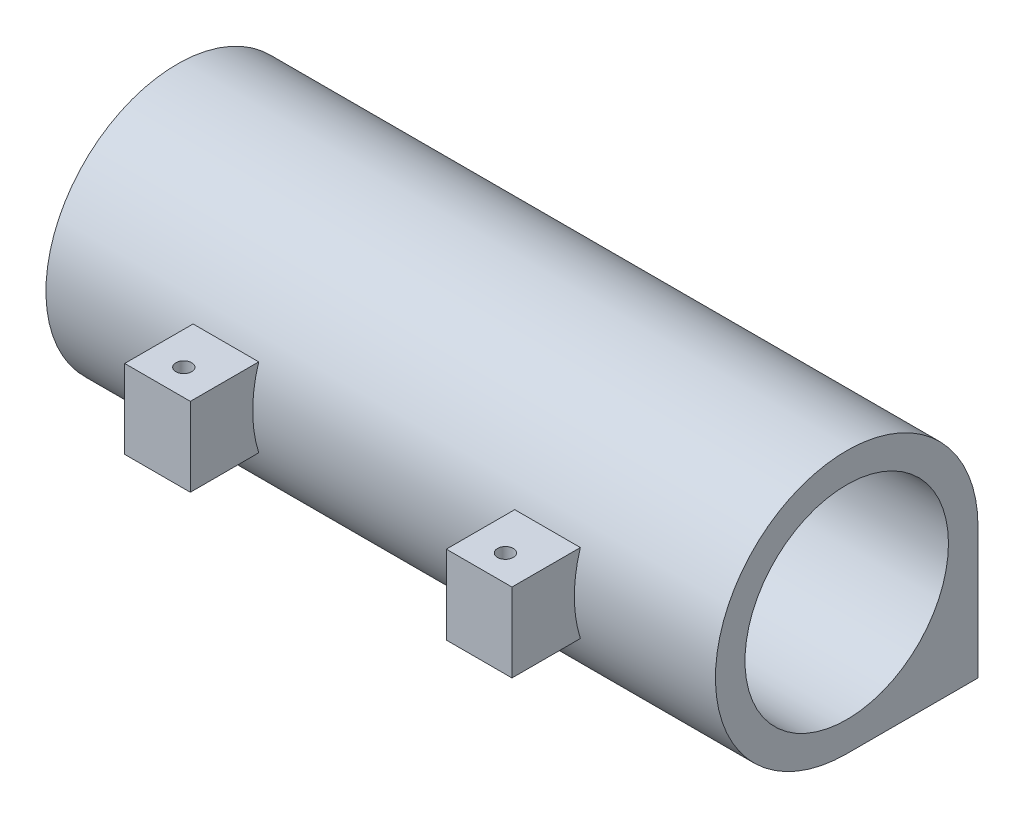
ISO-10303-21;
HEADER;
FILE_DESCRIPTION(('STEP AP214'),'2;1');
FILE_NAME('part.step','',(''),(''),'','','');
FILE_SCHEMA(('AUTOMOTIVE_DESIGN { 1 0 10303 214 1 1 1 1 }'));
ENDSEC;
DATA;
#1=APPLICATION_CONTEXT('core data for automotive mechanical design processes');
#2=APPLICATION_PROTOCOL_DEFINITION('international standard','automotive_design',2000,#1);
#3=PRODUCT_CONTEXT('',#1,'mechanical');
#4=PRODUCT('Part','Part','',(#3));
#5=PRODUCT_RELATED_PRODUCT_CATEGORY('part','',(#4));
#6=PRODUCT_DEFINITION_FORMATION('','',#4);
#7=PRODUCT_DEFINITION_CONTEXT('part definition',#1,'design');
#8=PRODUCT_DEFINITION('design','',#6,#7);
#9=PRODUCT_DEFINITION_SHAPE('','',#8);
#10=(LENGTH_UNIT() NAMED_UNIT(*) SI_UNIT(.MILLI.,.METRE.));
#11=(NAMED_UNIT(*) PLANE_ANGLE_UNIT() SI_UNIT($,.RADIAN.));
#12=(NAMED_UNIT(*) SI_UNIT($,.STERADIAN.) SOLID_ANGLE_UNIT());
#13=UNCERTAINTY_MEASURE_WITH_UNIT(LENGTH_MEASURE(1.E-05),#10,'distance_accuracy_value','');
#14=(GEOMETRIC_REPRESENTATION_CONTEXT(3) GLOBAL_UNCERTAINTY_ASSIGNED_CONTEXT((#13)) GLOBAL_UNIT_ASSIGNED_CONTEXT((#10,
#11,#12)) REPRESENTATION_CONTEXT('',''));
#15=CARTESIAN_POINT('',(0.,0.,0.));
#16=DIRECTION('',(0.,0.,1.));
#17=DIRECTION('',(1.,0.,0.));
#18=AXIS2_PLACEMENT_3D('',#15,#16,#17);
#19=CARTESIAN_POINT('',(0.,1.14590202813815,3.94518317727533));
#20=DIRECTION('',(1.,0.,0.));
#21=DIRECTION('',(0.,0.,-1.));
#22=AXIS2_PLACEMENT_3D('',#19,#20,#21);
#23=CYLINDRICAL_SURFACE('',#22,10.);
#24=CARTESIAN_POINT('',(15.75,1.14590202813815,3.94518317727533));
#25=DIRECTION('',(-1.,0.,0.));
#26=DIRECTION('',(0.,0.,-1.));
#27=AXIS2_PLACEMENT_3D('',#24,#25,#26);
#28=CIRCLE('',#27,10.);
#29=CARTESIAN_POINT('',(15.75,-1.85409797186185,13.4845751914448));
#30=VERTEX_POINT('',#29);
#31=CARTESIAN_POINT('',(15.75,4.14590202813815,13.4845751914448));
#32=VERTEX_POINT('',#31);
#33=EDGE_CURVE('E203',#30,#32,#28,.T.);
#34=ORIENTED_EDGE('',*,*,#33,.F.);
#35=DIRECTION('',(1.,0.,0.));
#36=VECTOR('',#35,1.);
#37=CARTESIAN_POINT('',(0.,-1.85409797186185,13.4845751914448));
#38=LINE('',#37,#36);
#39=CARTESIAN_POINT('',(10.75,-1.85409797186185,13.4845751914448));
#40=VERTEX_POINT('',#39);
#41=EDGE_CURVE('E41',#30,#40,#38,.F.);
#42=ORIENTED_EDGE('',*,*,#41,.T.);
#43=CARTESIAN_POINT('',(10.75,1.14590202813815,3.94518317727533));
#44=DIRECTION('',(1.,0.,0.));
#45=DIRECTION('',(0.,0.,1.));
#46=AXIS2_PLACEMENT_3D('',#43,#44,#45);
#47=CIRCLE('',#46,10.);
#48=CARTESIAN_POINT('',(10.75,4.14590202813815,13.4845751914448));
#49=VERTEX_POINT('',#48);
#50=EDGE_CURVE('E156',#49,#40,#47,.T.);
#51=ORIENTED_EDGE('',*,*,#50,.F.);
#52=DIRECTION('',(1.,0.,0.));
#53=VECTOR('',#52,1.);
#54=CARTESIAN_POINT('',(0.,4.14590202813815,13.4845751914448));
#55=LINE('',#54,#53);
#56=EDGE_CURVE('E54',#49,#32,#55,.T.);
#57=ORIENTED_EDGE('',*,*,#56,.T.);
#58=EDGE_LOOP('',(#34,#42,#51,#57));
#59=FACE_BOUND('',#58,.T.);
#60=DIRECTION('',(1.,0.,0.));
#61=VECTOR('',#60,1.);
#62=CARTESIAN_POINT('',(0.,1.14590202813815,-6.05481682272466));
#63=LINE('',#62,#61);
#64=CARTESIAN_POINT('',(0.,1.14590202813815,-6.05481682272466));
#65=VERTEX_POINT('',#64);
#66=CARTESIAN_POINT('',(24.997506218944,1.14590202813816,-6.05481682272466));
#67=VERTEX_POINT('',#66);
#68=EDGE_CURVE('E251',#65,#67,#63,.T.);
#69=ORIENTED_EDGE('',*,*,#68,.F.);
#70=CARTESIAN_POINT('',(0.,1.14590202813815,3.94518317727533));
#71=DIRECTION('',(-1.,0.,0.));
#72=DIRECTION('',(0.,0.,-1.));
#73=AXIS2_PLACEMENT_3D('',#70,#71,#72);
#74=CIRCLE('',#73,10.);
#75=CARTESIAN_POINT('',(0.,-8.85409797186184,3.94518317727534));
#76=VERTEX_POINT('',#75);
#77=EDGE_CURVE('E246',#76,#65,#74,.T.);
#78=ORIENTED_EDGE('',*,*,#77,.F.);
#79=DIRECTION('',(1.,0.,0.));
#80=VECTOR('',#79,1.);
#81=CARTESIAN_POINT('',(0.,-8.85409797186184,3.94518317727534));
#82=LINE('',#81,#80);
#83=CARTESIAN_POINT('',(51.,-8.85409797186184,3.94518317727534));
#84=VERTEX_POINT('',#83);
#85=EDGE_CURVE('E248',#76,#84,#82,.T.);
#86=ORIENTED_EDGE('',*,*,#85,.T.);
#87=CARTESIAN_POINT('',(51.,1.14590202813815,3.94518317727533));
#88=DIRECTION('',(-1.,0.,0.));
#89=DIRECTION('',(0.,0.,-1.));
#90=AXIS2_PLACEMENT_3D('',#87,#88,#89);
#91=CIRCLE('',#90,10.);
#92=CARTESIAN_POINT('',(51.,1.14590202813815,-6.05481682272466));
#93=VERTEX_POINT('',#92);
#94=EDGE_CURVE('E249',#84,#93,#91,.T.);
#95=ORIENTED_EDGE('',*,*,#94,.T.);
#96=DIRECTION('',(1.,0.,0.));
#97=VECTOR('',#96,1.);
#98=CARTESIAN_POINT('',(0.,1.14590202813816,-6.05481682272466));
#99=LINE('',#98,#97);
#100=CARTESIAN_POINT('',(26.002493781056,1.14590202813815,-6.05481682272466));
#101=VERTEX_POINT('',#100);
#102=EDGE_CURVE('E627',#93,#101,#99,.F.);
#103=ORIENTED_EDGE('',*,*,#102,.T.);
#104=CARTESIAN_POINT('',(24.997506218944,1.14590202813815,-6.05481682272466));
#105=CARTESIAN_POINT('',(25.0805573556213,1.16260914662107,-6.05480645906414));
#106=CARTESIAN_POINT('',(25.1644430815888,1.17514999884492,-6.0547749531659));
#107=CARTESIAN_POINT('',(25.332224567524,1.19175578689978,-6.05471766094674));
#108=CARTESIAN_POINT('',(25.416112283762,1.19590202813815,-6.05469182194342));
#109=CARTESIAN_POINT('',(25.583887716238,1.19590202813815,-6.05469182194342));
#110=CARTESIAN_POINT('',(25.667775432476,1.19175578689978,-6.05471766094674));
#111=CARTESIAN_POINT('',(25.8355569184112,1.17514999884492,-6.0547749531659));
#112=CARTESIAN_POINT('',(25.9194426443787,1.16260914662107,-6.05480645906413));
#113=CARTESIAN_POINT('',(26.002493781056,1.14590202813815,-6.05481682272466));
#114=B_SPLINE_CURVE_WITH_KNOTS('',3,(#104,#105,#106,#107,#108,#109,#110,#111,#112,#113),
.UNSPECIFIED.,.F.,.F.,(4,2,2,2,4),(0.,0.254034597945216,0.50559675972381,0.757158921502405,
1.01119351944762),.UNSPECIFIED.);
#115=EDGE_CURVE('E254',#67,#101,#114,.T.);
#116=ORIENTED_EDGE('',*,*,#115,.F.);
#117=EDGE_LOOP('',(#69,#78,#86,#95,#103,#116));
#118=FACE_BOUND('',#117,.T.);
#119=CARTESIAN_POINT('',(40.25,-1.85409797186185,13.4845751914448));
#120=VERTEX_POINT('',#119);
#121=CARTESIAN_POINT('',(35.25,-1.85409797186185,13.4845751914448));
#122=VERTEX_POINT('',#121);
#123=EDGE_CURVE('E11',#120,#122,#38,.F.);
#124=ORIENTED_EDGE('',*,*,#123,.T.);
#125=CARTESIAN_POINT('',(35.25,1.14590202813815,3.94518317727533));
#126=DIRECTION('',(1.,0.,0.));
#127=DIRECTION('',(0.,0.,1.));
#128=AXIS2_PLACEMENT_3D('',#125,#126,#127);
#129=CIRCLE('',#128,10.);
#130=CARTESIAN_POINT('',(35.25,4.14590202813815,13.4845751914448));
#131=VERTEX_POINT('',#130);
#132=EDGE_CURVE('E194',#131,#122,#129,.T.);
#133=ORIENTED_EDGE('',*,*,#132,.F.);
#134=CARTESIAN_POINT('',(40.25,4.14590202813815,13.4845751914448));
#135=VERTEX_POINT('',#134);
#136=EDGE_CURVE('E305',#131,#135,#55,.T.);
#137=ORIENTED_EDGE('',*,*,#136,.T.);
#138=CARTESIAN_POINT('',(40.25,1.14590202813815,3.94518317727533));
#139=DIRECTION('',(-1.,0.,0.));
#140=DIRECTION('',(0.,0.,-1.));
#141=AXIS2_PLACEMENT_3D('',#138,#139,#140);
#142=CIRCLE('',#141,10.);
#143=EDGE_CURVE('E209',#120,#135,#142,.T.);
#144=ORIENTED_EDGE('',*,*,#143,.F.);
#145=EDGE_LOOP('',(#124,#133,#137,#144));
#146=FACE_BOUND('',#145,.T.);
#147=ADVANCED_FACE('F33',(#59,#118,#146),#23,.T.);
#148=CARTESIAN_POINT('',(0.,-1.85409797186185,11.6951831772753));
#149=DIRECTION('',(0.,-1.,0.));
#150=DIRECTION('',(0.,0.,-1.));
#151=AXIS2_PLACEMENT_3D('',#148,#149,#150);
#152=PLANE('',#151);
#153=CARTESIAN_POINT('',(13.25,-1.85409797186185,16.6951831772753));
#154=DIRECTION('',(0.,-1.,0.));
#155=DIRECTION('',(0.,0.,-1.));
#156=AXIS2_PLACEMENT_3D('',#153,#154,#155);
#157=CIRCLE('',#156,0.6);
#158=CARTESIAN_POINT('',(13.25,-1.85409797186185,16.0951831772753));
#159=VERTEX_POINT('',#158);
#160=EDGE_CURVE('E173',#159,#159,#157,.T.);
#161=ORIENTED_EDGE('',*,*,#160,.F.);
#162=EDGE_LOOP('',(#161));
#163=FACE_BOUND('',#162,.T.);
#164=ORIENTED_EDGE('',*,*,#41,.F.);
#165=DIRECTION('',(0.,0.,-1.));
#166=VECTOR('',#165,1.);
#167=CARTESIAN_POINT('',(15.75,-1.85409797186185,13.4845751914448));
#168=LINE('',#167,#166);
#169=CARTESIAN_POINT('',(15.75,-1.85409797186185,18.6951831772753));
#170=VERTEX_POINT('',#169);
#171=EDGE_CURVE('E163',#170,#30,#168,.T.);
#172=ORIENTED_EDGE('',*,*,#171,.F.);
#173=DIRECTION('',(1.,0.,0.));
#174=VECTOR('',#173,1.);
#175=CARTESIAN_POINT('',(10.75,-1.85409797186185,18.6951831772753));
#176=LINE('',#175,#174);
#177=CARTESIAN_POINT('',(10.75,-1.85409797186185,18.6951831772753));
#178=VERTEX_POINT('',#177);
#179=EDGE_CURVE('E160',#178,#170,#176,.T.);
#180=ORIENTED_EDGE('',*,*,#179,.F.);
#181=DIRECTION('',(0.,0.,1.));
#182=VECTOR('',#181,1.);
#183=CARTESIAN_POINT('',(10.75,-1.85409797186185,17.6951831772753));
#184=LINE('',#183,#182);
#185=EDGE_CURVE('E150',#40,#178,#184,.T.);
#186=ORIENTED_EDGE('',*,*,#185,.F.);
#187=EDGE_LOOP('',(#164,#172,#180,#186));
#188=FACE_BOUND('',#187,.T.);
#189=ADVANCED_FACE('F161',(#163,#188),#152,.T.);
#190=CARTESIAN_POINT('',(0.,4.14590202813815,17.6951831772753));
#191=DIRECTION('',(0.,1.,0.));
#192=DIRECTION('',(0.,0.,1.));
#193=AXIS2_PLACEMENT_3D('',#190,#191,#192);
#194=PLANE('',#193);
#195=CARTESIAN_POINT('',(13.25,4.14590202813815,16.6951831772753));
#196=DIRECTION('',(0.,1.,0.));
#197=DIRECTION('',(0.,0.,1.));
#198=AXIS2_PLACEMENT_3D('',#195,#196,#197);
#199=CIRCLE('',#198,0.6);
#200=CARTESIAN_POINT('',(13.25,4.14590202813815,17.2951831772753));
#201=VERTEX_POINT('',#200);
#202=EDGE_CURVE('E176',#201,#201,#199,.T.);
#203=ORIENTED_EDGE('',*,*,#202,.F.);
#204=EDGE_LOOP('',(#203));
#205=FACE_BOUND('',#204,.T.);
#206=DIRECTION('',(0.,0.,-1.));
#207=VECTOR('',#206,1.);
#208=CARTESIAN_POINT('',(10.75,4.14590202813815,13.4845751914448));
#209=LINE('',#208,#207);
#210=CARTESIAN_POINT('',(10.75,4.14590202813815,18.6951831772753));
#211=VERTEX_POINT('',#210);
#212=EDGE_CURVE('E157',#211,#49,#209,.T.);
#213=ORIENTED_EDGE('',*,*,#212,.F.);
#214=DIRECTION('',(-1.,0.,0.));
#215=VECTOR('',#214,1.);
#216=CARTESIAN_POINT('',(10.75,4.14590202813815,18.6951831772753));
#217=LINE('',#216,#215);
#218=CARTESIAN_POINT('',(15.75,4.14590202813815,18.6951831772753));
#219=VERTEX_POINT('',#218);
#220=EDGE_CURVE('E172',#219,#211,#217,.T.);
#221=ORIENTED_EDGE('',*,*,#220,.F.);
#222=DIRECTION('',(0.,0.,1.));
#223=VECTOR('',#222,1.);
#224=CARTESIAN_POINT('',(15.75,4.14590202813815,17.6951831772753));
#225=LINE('',#224,#223);
#226=EDGE_CURVE('E205',#32,#219,#225,.T.);
#227=ORIENTED_EDGE('',*,*,#226,.F.);
#228=ORIENTED_EDGE('',*,*,#56,.F.);
#229=EDGE_LOOP('',(#213,#221,#227,#228));
#230=FACE_BOUND('',#229,.T.);
#231=ADVANCED_FACE('F316',(#205,#230),#194,.T.);
#232=CARTESIAN_POINT('',(37.75,-1.85409797186185,16.6951831772753));
#233=DIRECTION('',(0.,-1.,0.));
#234=DIRECTION('',(0.,0.,-1.));
#235=AXIS2_PLACEMENT_3D('',#232,#233,#234);
#236=CIRCLE('',#235,0.6);
#237=CARTESIAN_POINT('',(37.75,-1.85409797186185,16.0951831772753));
#238=VERTEX_POINT('',#237);
#239=EDGE_CURVE('E386',#238,#238,#236,.T.);
#240=ORIENTED_EDGE('',*,*,#239,.F.);
#241=EDGE_LOOP('',(#240));
#242=FACE_BOUND('',#241,.T.);
#243=DIRECTION('',(0.,0.,-1.));
#244=VECTOR('',#243,1.);
#245=CARTESIAN_POINT('',(40.25,-1.85409797186185,17.6951831772753));
#246=LINE('',#245,#244);
#247=CARTESIAN_POINT('',(40.25,-1.85409797186185,18.6951831772753));
#248=VERTEX_POINT('',#247);
#249=EDGE_CURVE('E214',#248,#120,#246,.T.);
#250=ORIENTED_EDGE('',*,*,#249,.F.);
#251=DIRECTION('',(1.,0.,0.));
#252=VECTOR('',#251,1.);
#253=CARTESIAN_POINT('',(35.25,-1.85409797186185,18.6951831772753));
#254=LINE('',#253,#252);
#255=CARTESIAN_POINT('',(35.25,-1.85409797186185,18.6951831772753));
#256=VERTEX_POINT('',#255);
#257=EDGE_CURVE('E185',#256,#248,#254,.T.);
#258=ORIENTED_EDGE('',*,*,#257,.F.);
#259=DIRECTION('',(0.,0.,1.));
#260=VECTOR('',#259,1.);
#261=CARTESIAN_POINT('',(35.25,-1.85409797186185,17.6951831772753));
#262=LINE('',#261,#260);
#263=EDGE_CURVE('E197',#122,#256,#262,.T.);
#264=ORIENTED_EDGE('',*,*,#263,.F.);
#265=ORIENTED_EDGE('',*,*,#123,.F.);
#266=EDGE_LOOP('',(#250,#258,#264,#265));
#267=FACE_BOUND('',#266,.T.);
#268=ADVANCED_FACE('F318',(#242,#267),#152,.T.);
#269=CARTESIAN_POINT('',(37.75,4.14590202813815,16.6951831772753));
#270=DIRECTION('',(0.,1.,0.));
#271=DIRECTION('',(0.,0.,1.));
#272=AXIS2_PLACEMENT_3D('',#269,#270,#271);
#273=CIRCLE('',#272,0.6);
#274=CARTESIAN_POINT('',(37.75,4.14590202813815,17.2951831772753));
#275=VERTEX_POINT('',#274);
#276=EDGE_CURVE('E337',#275,#275,#273,.T.);
#277=ORIENTED_EDGE('',*,*,#276,.F.);
#278=EDGE_LOOP('',(#277));
#279=FACE_BOUND('',#278,.T.);
#280=ORIENTED_EDGE('',*,*,#136,.F.);
#281=DIRECTION('',(0.,0.,-1.));
#282=VECTOR('',#281,1.);
#283=CARTESIAN_POINT('',(35.25,4.14590202813815,13.4845751914448));
#284=LINE('',#283,#282);
#285=CARTESIAN_POINT('',(35.25,4.14590202813815,18.6951831772753));
#286=VERTEX_POINT('',#285);
#287=EDGE_CURVE('E199',#286,#131,#284,.T.);
#288=ORIENTED_EDGE('',*,*,#287,.F.);
#289=DIRECTION('',(-1.,0.,0.));
#290=VECTOR('',#289,1.);
#291=CARTESIAN_POINT('',(35.25,4.14590202813815,18.6951831772753));
#292=LINE('',#291,#290);
#293=CARTESIAN_POINT('',(40.25,4.14590202813815,18.6951831772753));
#294=VERTEX_POINT('',#293);
#295=EDGE_CURVE('E191',#294,#286,#292,.T.);
#296=ORIENTED_EDGE('',*,*,#295,.F.);
#297=DIRECTION('',(0.,0.,1.));
#298=VECTOR('',#297,1.);
#299=CARTESIAN_POINT('',(40.25,4.14590202813815,13.4845751914448));
#300=LINE('',#299,#298);
#301=EDGE_CURVE('E212',#135,#294,#300,.T.);
#302=ORIENTED_EDGE('',*,*,#301,.F.);
#303=EDGE_LOOP('',(#280,#288,#296,#302));
#304=FACE_BOUND('',#303,.T.);
#305=ADVANCED_FACE('F285',(#279,#304),#194,.T.);
#306=CARTESIAN_POINT('',(25.5,-1.35409797186185,-3.05481682272466));
#307=DIRECTION('',(0.,0.,-1.));
#308=DIRECTION('',(0.,1.,0.));
#309=AXIS2_PLACEMENT_3D('',#306,#307,#308);
#310=CYLINDRICAL_SURFACE('',#309,2.55);
#311=CARTESIAN_POINT('',(25.5,-1.35409797186185,-6.05481682272466));
#312=DIRECTION('',(0.,0.,1.));
#313=DIRECTION('',(0.,-1.,0.));
#314=AXIS2_PLACEMENT_3D('',#311,#312,#313);
#315=CIRCLE('',#314,2.55);
#316=EDGE_CURVE('E636',#101,#67,#315,.F.);
#317=ORIENTED_EDGE('',*,*,#316,.T.);
#318=ORIENTED_EDGE('',*,*,#115,.T.);
#319=EDGE_LOOP('',(#317,#318));
#320=FACE_BOUND('',#319,.T.);
#321=CARTESIAN_POINT('',(25.5,-1.35409797186185,-4.55481682272466));
#322=DIRECTION('',(0.,0.,1.));
#323=DIRECTION('',(0.,-1.,0.));
#324=AXIS2_PLACEMENT_3D('',#321,#322,#323);
#325=CIRCLE('',#324,2.55);
#326=CARTESIAN_POINT('',(25.5,-3.90409797186185,-4.55481682272466));
#327=VERTEX_POINT('',#326);
#328=EDGE_CURVE('E245',#327,#327,#325,.F.);
#329=ORIENTED_EDGE('',*,*,#328,.F.);
#330=EDGE_LOOP('',(#329));
#331=FACE_BOUND('',#330,.T.);
#332=ADVANCED_FACE('F266',(#320,#331),#310,.F.);
#333=CARTESIAN_POINT('',(0.,1.14590202813815,3.94518317727533));
#334=DIRECTION('',(1.,0.,0.));
#335=DIRECTION('',(0.,0.,-1.));
#336=AXIS2_PLACEMENT_3D('',#333,#334,#335);
#337=CYLINDRICAL_SURFACE('',#336,7.75);
#338=CARTESIAN_POINT('',(0.,1.14590202813815,3.94518317727533));
#339=DIRECTION('',(1.,0.,0.));
#340=DIRECTION('',(0.,0.,-1.));
#341=AXIS2_PLACEMENT_3D('',#338,#339,#340);
#342=CIRCLE('',#341,7.75);
#343=CARTESIAN_POINT('',(0.,1.14590202813815,-3.80481682272467));
#344=VERTEX_POINT('',#343);
#345=EDGE_CURVE('E290',#344,#344,#342,.T.);
#346=ORIENTED_EDGE('',*,*,#345,.F.);
#347=EDGE_LOOP('',(#346));
#348=FACE_BOUND('',#347,.T.);
#349=CARTESIAN_POINT('',(51.,1.14590202813815,3.94518317727533));
#350=DIRECTION('',(1.,0.,0.));
#351=DIRECTION('',(0.,0.,-1.));
#352=AXIS2_PLACEMENT_3D('',#349,#350,#351);
#353=CIRCLE('',#352,7.75);
#354=CARTESIAN_POINT('',(51.,1.14590202813815,-3.80481682272467));
#355=VERTEX_POINT('',#354);
#356=EDGE_CURVE('E294',#355,#355,#353,.T.);
#357=ORIENTED_EDGE('',*,*,#356,.T.);
#358=EDGE_LOOP('',(#357));
#359=FACE_BOUND('',#358,.T.);
#360=DIRECTION('',(1.,0.,0.));
#361=VECTOR('',#360,1.);
#362=CARTESIAN_POINT('',(0.,2.19590202813815,-3.73335835090565));
#363=LINE('',#362,#361);
#364=CARTESIAN_POINT('',(29.25,2.19590202813815,-3.73335835090565));
#365=VERTEX_POINT('',#364);
#366=CARTESIAN_POINT('',(21.75,2.19590202813815,-3.73335835090565));
#367=VERTEX_POINT('',#366);
#368=EDGE_CURVE('E298',#365,#367,#363,.F.);
#369=ORIENTED_EDGE('',*,*,#368,.F.);
#370=CARTESIAN_POINT('',(29.25,1.14590202813815,3.94518317727533));
#371=DIRECTION('',(-1.,0.,0.));
#372=DIRECTION('',(0.,0.,1.));
#373=AXIS2_PLACEMENT_3D('',#370,#371,#372);
#374=CIRCLE('',#373,7.75);
#375=CARTESIAN_POINT('',(29.25,-4.31418038882224,-1.55481682272466));
#376=VERTEX_POINT('',#375);
#377=EDGE_CURVE('E300',#376,#365,#374,.F.);
#378=ORIENTED_EDGE('',*,*,#377,.F.);
#379=DIRECTION('',(1.,0.,0.));
#380=VECTOR('',#379,1.);
#381=CARTESIAN_POINT('',(0.,-4.31418038882224,-1.55481682272466));
#382=LINE('',#381,#380);
#383=CARTESIAN_POINT('',(21.75,-4.31418038882224,-1.55481682272466));
#384=VERTEX_POINT('',#383);
#385=EDGE_CURVE('E630',#376,#384,#382,.F.);
#386=ORIENTED_EDGE('',*,*,#385,.T.);
#387=CARTESIAN_POINT('',(21.75,1.14590202813815,3.94518317727533));
#388=DIRECTION('',(1.,0.,0.));
#389=DIRECTION('',(0.,0.,-1.));
#390=AXIS2_PLACEMENT_3D('',#387,#388,#389);
#391=CIRCLE('',#390,7.75);
#392=EDGE_CURVE('E302',#367,#384,#391,.F.);
#393=ORIENTED_EDGE('',*,*,#392,.F.);
#394=EDGE_LOOP('',(#369,#378,#386,#393));
#395=FACE_BOUND('',#394,.T.);
#396=ADVANCED_FACE('F278',(#348,#359,#395),#337,.F.);
#397=CARTESIAN_POINT('',(0.,21.1459020281382,-6.05481682272466));
#398=DIRECTION('',(0.,0.,1.));
#399=DIRECTION('',(0.,-1.,0.));
#400=AXIS2_PLACEMENT_3D('',#397,#398,#399);
#401=PLANE('',#400);
#402=ORIENTED_EDGE('',*,*,#102,.F.);
#403=DIRECTION('',(0.,-1.,0.));
#404=VECTOR('',#403,1.);
#405=CARTESIAN_POINT('',(51.,21.1459020281382,-6.05481682272466));
#406=LINE('',#405,#404);
#407=CARTESIAN_POINT('',(51.,-8.85409797186185,-6.05481682272466));
#408=VERTEX_POINT('',#407);
#409=EDGE_CURVE('E263',#93,#408,#406,.T.);
#410=ORIENTED_EDGE('',*,*,#409,.T.);
#411=DIRECTION('',(1.,0.,0.));
#412=VECTOR('',#411,1.);
#413=CARTESIAN_POINT('',(0.,-8.85409797186185,-6.05481682272466));
#414=LINE('',#413,#412);
#415=CARTESIAN_POINT('',(0.,-8.85409797186185,-6.05481682272466));
#416=VERTEX_POINT('',#415);
#417=EDGE_CURVE('E623',#416,#408,#414,.T.);
#418=ORIENTED_EDGE('',*,*,#417,.F.);
#419=DIRECTION('',(0.,-1.,0.));
#420=VECTOR('',#419,1.);
#421=CARTESIAN_POINT('',(0.,21.1459020281382,-6.05481682272466));
#422=LINE('',#421,#420);
#423=EDGE_CURVE('E264',#65,#416,#422,.T.);
#424=ORIENTED_EDGE('',*,*,#423,.F.);
#425=ORIENTED_EDGE('',*,*,#68,.T.);
#426=ORIENTED_EDGE('',*,*,#316,.F.);
#427=EDGE_LOOP('',(#402,#410,#418,#424,#425,#426));
#428=FACE_BOUND('',#427,.T.);
#429=ADVANCED_FACE('F276',(#428),#401,.F.);
#430=CARTESIAN_POINT('',(51.,-8.85409797186185,20.9451831772753));
#431=DIRECTION('',(0.,1.,0.));
#432=DIRECTION('',(0.,0.,1.));
#433=AXIS2_PLACEMENT_3D('',#430,#431,#432);
#434=PLANE('',#433);
#435=DIRECTION('',(0.,0.,-1.));
#436=VECTOR('',#435,1.);
#437=CARTESIAN_POINT('',(51.,-8.85409797186185,20.9451831772753));
#438=LINE('',#437,#436);
#439=EDGE_CURVE('E620',#84,#408,#438,.T.);
#440=ORIENTED_EDGE('',*,*,#439,.F.);
#441=ORIENTED_EDGE('',*,*,#85,.F.);
#442=DIRECTION('',(0.,0.,-1.));
#443=VECTOR('',#442,1.);
#444=CARTESIAN_POINT('',(0.,-8.85409797186185,20.9451831772753));
#445=LINE('',#444,#443);
#446=EDGE_CURVE('E628',#76,#416,#445,.T.);
#447=ORIENTED_EDGE('',*,*,#446,.T.);
#448=ORIENTED_EDGE('',*,*,#417,.T.);
#449=EDGE_LOOP('',(#440,#441,#447,#448));
#450=FACE_BOUND('',#449,.T.);
#451=ADVANCED_FACE('F35',(#450),#434,.F.);
#452=CARTESIAN_POINT('',(51.,0.,0.));
#453=DIRECTION('',(1.,0.,0.));
#454=DIRECTION('',(0.,0.,-1.));
#455=AXIS2_PLACEMENT_3D('',#452,#453,#454);
#456=PLANE('',#455);
#457=ORIENTED_EDGE('',*,*,#409,.F.);
#458=ORIENTED_EDGE('',*,*,#94,.F.);
#459=ORIENTED_EDGE('',*,*,#439,.T.);
#460=EDGE_LOOP('',(#457,#458,#459));
#461=FACE_BOUND('',#460,.T.);
#462=ORIENTED_EDGE('',*,*,#356,.F.);
#463=EDGE_LOOP('',(#462));
#464=FACE_BOUND('',#463,.T.);
#465=ADVANCED_FACE('F526',(#461,#464),#456,.T.);
#466=CARTESIAN_POINT('',(0.,0.,0.));
#467=DIRECTION('',(1.,0.,0.));
#468=DIRECTION('',(0.,0.,-1.));
#469=AXIS2_PLACEMENT_3D('',#466,#467,#468);
#470=PLANE('',#469);
#471=ORIENTED_EDGE('',*,*,#77,.T.);
#472=ORIENTED_EDGE('',*,*,#423,.T.);
#473=ORIENTED_EDGE('',*,*,#446,.F.);
#474=EDGE_LOOP('',(#471,#472,#473));
#475=FACE_BOUND('',#474,.T.);
#476=ORIENTED_EDGE('',*,*,#345,.T.);
#477=EDGE_LOOP('',(#476));
#478=FACE_BOUND('',#477,.T.);
#479=ADVANCED_FACE('F519',(#475,#478),#470,.F.);
#480=CARTESIAN_POINT('',(0.,0.,-4.55481682272466));
#481=DIRECTION('',(0.,0.,1.));
#482=DIRECTION('',(0.,-1.,0.));
#483=AXIS2_PLACEMENT_3D('',#480,#481,#482);
#484=PLANE('',#483);
#485=DIRECTION('',(0.,1.,0.));
#486=VECTOR('',#485,1.);
#487=CARTESIAN_POINT('',(21.75,-2.18013164577437,-4.55481682272466));
#488=LINE('',#487,#486);
#489=CARTESIAN_POINT('',(21.75,-4.90409797186185,-4.55481682272466));
#490=VERTEX_POINT('',#489);
#491=CARTESIAN_POINT('',(21.75,2.19590202813815,-4.55481682272466));
#492=VERTEX_POINT('',#491);
#493=EDGE_CURVE('E224',#490,#492,#488,.T.);
#494=ORIENTED_EDGE('',*,*,#493,.F.);
#495=DIRECTION('',(-1.,0.,0.));
#496=VECTOR('',#495,1.);
#497=CARTESIAN_POINT('',(21.75,-4.90409797186185,-4.55481682272466));
#498=LINE('',#497,#496);
#499=CARTESIAN_POINT('',(29.25,-4.90409797186185,-4.55481682272466));
#500=VERTEX_POINT('',#499);
#501=EDGE_CURVE('E231',#500,#490,#498,.T.);
#502=ORIENTED_EDGE('',*,*,#501,.F.);
#503=DIRECTION('',(0.,-1.,0.));
#504=VECTOR('',#503,1.);
#505=CARTESIAN_POINT('',(29.25,-2.18013164577437,-4.55481682272466));
#506=LINE('',#505,#504);
#507=CARTESIAN_POINT('',(29.25,2.19590202813815,-4.55481682272466));
#508=VERTEX_POINT('',#507);
#509=EDGE_CURVE('E229',#508,#500,#506,.T.);
#510=ORIENTED_EDGE('',*,*,#509,.F.);
#511=DIRECTION('',(1.,0.,0.));
#512=VECTOR('',#511,1.);
#513=CARTESIAN_POINT('',(29.25,2.19590202813815,-4.55481682272466));
#514=LINE('',#513,#512);
#515=EDGE_CURVE('E227',#492,#508,#514,.T.);
#516=ORIENTED_EDGE('',*,*,#515,.F.);
#517=EDGE_LOOP('',(#494,#502,#510,#516));
#518=FACE_BOUND('',#517,.T.);
#519=ORIENTED_EDGE('',*,*,#328,.T.);
#520=EDGE_LOOP('',(#519));
#521=FACE_BOUND('',#520,.T.);
#522=ADVANCED_FACE('F525',(#518,#521),#484,.T.);
#523=CARTESIAN_POINT('',(29.25,2.19590202813815,-4.55481682272466));
#524=DIRECTION('',(0.,-1.,0.));
#525=DIRECTION('',(0.,0.,-1.));
#526=AXIS2_PLACEMENT_3D('',#523,#524,#525);
#527=PLANE('',#526);
#528=ORIENTED_EDGE('',*,*,#368,.T.);
#529=DIRECTION('',(0.,0.,1.));
#530=VECTOR('',#529,1.);
#531=CARTESIAN_POINT('',(21.75,2.19590202813815,-4.55481682272466));
#532=LINE('',#531,#530);
#533=EDGE_CURVE('E242',#492,#367,#532,.T.);
#534=ORIENTED_EDGE('',*,*,#533,.F.);
#535=ORIENTED_EDGE('',*,*,#515,.T.);
#536=DIRECTION('',(0.,0.,1.));
#537=VECTOR('',#536,1.);
#538=CARTESIAN_POINT('',(29.25,2.19590202813815,-4.55481682272466));
#539=LINE('',#538,#537);
#540=EDGE_CURVE('E239',#508,#365,#539,.T.);
#541=ORIENTED_EDGE('',*,*,#540,.T.);
#542=EDGE_LOOP('',(#528,#534,#535,#541));
#543=FACE_BOUND('',#542,.T.);
#544=ADVANCED_FACE('F274',(#543),#527,.T.);
#545=CARTESIAN_POINT('',(29.25,-2.18013164577437,-4.55481682272466));
#546=DIRECTION('',(-1.,0.,0.));
#547=DIRECTION('',(0.,0.,1.));
#548=AXIS2_PLACEMENT_3D('',#545,#546,#547);
#549=PLANE('',#548);
#550=ORIENTED_EDGE('',*,*,#377,.T.);
#551=ORIENTED_EDGE('',*,*,#540,.F.);
#552=ORIENTED_EDGE('',*,*,#509,.T.);
#553=DIRECTION('',(0.,0.,1.));
#554=VECTOR('',#553,1.);
#555=CARTESIAN_POINT('',(29.25,-4.90409797186185,-4.55481682272466));
#556=LINE('',#555,#554);
#557=CARTESIAN_POINT('',(29.25,-4.90409797186185,-1.55481682272466));
#558=VERTEX_POINT('',#557);
#559=EDGE_CURVE('E236',#500,#558,#556,.T.);
#560=ORIENTED_EDGE('',*,*,#559,.T.);
#561=DIRECTION('',(0.,-1.,0.));
#562=VECTOR('',#561,1.);
#563=CARTESIAN_POINT('',(29.25,-2.18013164577437,-1.55481682272466));
#564=LINE('',#563,#562);
#565=EDGE_CURVE('E219',#376,#558,#564,.T.);
#566=ORIENTED_EDGE('',*,*,#565,.F.);
#567=EDGE_LOOP('',(#550,#551,#552,#560,#566));
#568=FACE_BOUND('',#567,.T.);
#569=ADVANCED_FACE('F561',(#568),#549,.T.);
#570=CARTESIAN_POINT('',(21.75,-2.18013164577437,-4.55481682272466));
#571=DIRECTION('',(1.,0.,0.));
#572=DIRECTION('',(0.,0.,-1.));
#573=AXIS2_PLACEMENT_3D('',#570,#571,#572);
#574=PLANE('',#573);
#575=ORIENTED_EDGE('',*,*,#392,.T.);
#576=DIRECTION('',(0.,1.,0.));
#577=VECTOR('',#576,1.);
#578=CARTESIAN_POINT('',(21.75,-2.18013164577437,-1.55481682272466));
#579=LINE('',#578,#577);
#580=CARTESIAN_POINT('',(21.75,-4.90409797186185,-1.55481682272466));
#581=VERTEX_POINT('',#580);
#582=EDGE_CURVE('E217',#581,#384,#579,.T.);
#583=ORIENTED_EDGE('',*,*,#582,.F.);
#584=DIRECTION('',(0.,0.,1.));
#585=VECTOR('',#584,1.);
#586=CARTESIAN_POINT('',(21.75,-4.90409797186185,-4.55481682272466));
#587=LINE('',#586,#585);
#588=EDGE_CURVE('E234',#490,#581,#587,.T.);
#589=ORIENTED_EDGE('',*,*,#588,.F.);
#590=ORIENTED_EDGE('',*,*,#493,.T.);
#591=ORIENTED_EDGE('',*,*,#533,.T.);
#592=EDGE_LOOP('',(#575,#583,#589,#590,#591));
#593=FACE_BOUND('',#592,.T.);
#594=ADVANCED_FACE('F553',(#593),#574,.T.);
#595=CARTESIAN_POINT('',(0.,0.,-1.55481682272466));
#596=DIRECTION('',(0.,0.,1.));
#597=DIRECTION('',(0.,-1.,0.));
#598=AXIS2_PLACEMENT_3D('',#595,#596,#597);
#599=PLANE('',#598);
#600=ORIENTED_EDGE('',*,*,#565,.T.);
#601=DIRECTION('',(-1.,0.,0.));
#602=VECTOR('',#601,1.);
#603=CARTESIAN_POINT('',(21.75,-4.90409797186185,-1.55481682272466));
#604=LINE('',#603,#602);
#605=EDGE_CURVE('E221',#558,#581,#604,.T.);
#606=ORIENTED_EDGE('',*,*,#605,.T.);
#607=ORIENTED_EDGE('',*,*,#582,.T.);
#608=ORIENTED_EDGE('',*,*,#385,.F.);
#609=EDGE_LOOP('',(#600,#606,#607,#608));
#610=FACE_BOUND('',#609,.T.);
#611=ADVANCED_FACE('F362',(#610),#599,.F.);
#612=CARTESIAN_POINT('',(21.75,-4.90409797186185,-4.55481682272466));
#613=DIRECTION('',(0.,1.,0.));
#614=DIRECTION('',(0.,0.,1.));
#615=AXIS2_PLACEMENT_3D('',#612,#613,#614);
#616=PLANE('',#615);
#617=ORIENTED_EDGE('',*,*,#559,.F.);
#618=ORIENTED_EDGE('',*,*,#501,.T.);
#619=ORIENTED_EDGE('',*,*,#588,.T.);
#620=ORIENTED_EDGE('',*,*,#605,.F.);
#621=EDGE_LOOP('',(#617,#618,#619,#620));
#622=FACE_BOUND('',#621,.T.);
#623=ADVANCED_FACE('F355',(#622),#616,.T.);
#624=CARTESIAN_POINT('',(40.25,1.14590202813815,3.94518317727533));
#625=DIRECTION('',(1.,0.,0.));
#626=DIRECTION('',(0.,0.,-1.));
#627=AXIS2_PLACEMENT_3D('',#624,#625,#626);
#628=PLANE('',#627);
#629=ORIENTED_EDGE('',*,*,#143,.T.);
#630=ORIENTED_EDGE('',*,*,#301,.T.);
#631=DIRECTION('',(0.,1.,0.));
#632=VECTOR('',#631,1.);
#633=CARTESIAN_POINT('',(40.25,-1.85409797186185,18.6951831772753));
#634=LINE('',#633,#632);
#635=EDGE_CURVE('E188',#248,#294,#634,.T.);
#636=ORIENTED_EDGE('',*,*,#635,.F.);
#637=ORIENTED_EDGE('',*,*,#249,.T.);
#638=EDGE_LOOP('',(#629,#630,#636,#637));
#639=FACE_BOUND('',#638,.T.);
#640=ADVANCED_FACE('F353',(#639),#628,.T.);
#641=CARTESIAN_POINT('',(10.75,1.14590202813815,3.94518317727533));
#642=DIRECTION('',(-1.,0.,0.));
#643=DIRECTION('',(0.,0.,1.));
#644=AXIS2_PLACEMENT_3D('',#641,#642,#643);
#645=PLANE('',#644);
#646=ORIENTED_EDGE('',*,*,#50,.T.);
#647=ORIENTED_EDGE('',*,*,#185,.T.);
#648=DIRECTION('',(0.,-1.,0.));
#649=VECTOR('',#648,1.);
#650=CARTESIAN_POINT('',(10.75,-1.85409797186185,18.6951831772753));
#651=LINE('',#650,#649);
#652=EDGE_CURVE('E155',#211,#178,#651,.T.);
#653=ORIENTED_EDGE('',*,*,#652,.F.);
#654=ORIENTED_EDGE('',*,*,#212,.T.);
#655=EDGE_LOOP('',(#646,#647,#653,#654));
#656=FACE_BOUND('',#655,.T.);
#657=ADVANCED_FACE('F152',(#656),#645,.T.);
#658=CARTESIAN_POINT('',(15.75,1.14590202813815,3.94518317727533));
#659=DIRECTION('',(1.,0.,0.));
#660=DIRECTION('',(0.,0.,-1.));
#661=AXIS2_PLACEMENT_3D('',#658,#659,#660);
#662=PLANE('',#661);
#663=ORIENTED_EDGE('',*,*,#171,.T.);
#664=ORIENTED_EDGE('',*,*,#33,.T.);
#665=ORIENTED_EDGE('',*,*,#226,.T.);
#666=DIRECTION('',(0.,1.,0.));
#667=VECTOR('',#666,1.);
#668=CARTESIAN_POINT('',(15.75,-1.85409797186185,18.6951831772753));
#669=LINE('',#668,#667);
#670=EDGE_CURVE('E167',#170,#219,#669,.T.);
#671=ORIENTED_EDGE('',*,*,#670,.F.);
#672=EDGE_LOOP('',(#663,#664,#665,#671));
#673=FACE_BOUND('',#672,.T.);
#674=ADVANCED_FACE('F314',(#673),#662,.T.);
#675=CARTESIAN_POINT('',(35.25,1.14590202813815,3.94518317727533));
#676=DIRECTION('',(-1.,0.,0.));
#677=DIRECTION('',(0.,0.,1.));
#678=AXIS2_PLACEMENT_3D('',#675,#676,#677);
#679=PLANE('',#678);
#680=ORIENTED_EDGE('',*,*,#132,.T.);
#681=ORIENTED_EDGE('',*,*,#263,.T.);
#682=DIRECTION('',(0.,-1.,0.));
#683=VECTOR('',#682,1.);
#684=CARTESIAN_POINT('',(35.25,-1.85409797186185,18.6951831772753));
#685=LINE('',#684,#683);
#686=EDGE_CURVE('E182',#286,#256,#685,.T.);
#687=ORIENTED_EDGE('',*,*,#686,.F.);
#688=ORIENTED_EDGE('',*,*,#287,.T.);
#689=EDGE_LOOP('',(#680,#681,#687,#688));
#690=FACE_BOUND('',#689,.T.);
#691=ADVANCED_FACE('F345',(#690),#679,.T.);
#692=CARTESIAN_POINT('',(0.,0.,18.6951831772753));
#693=DIRECTION('',(0.,0.,-1.));
#694=DIRECTION('',(-1.,0.,0.));
#695=AXIS2_PLACEMENT_3D('',#692,#693,#694);
#696=PLANE('',#695);
#697=ORIENTED_EDGE('',*,*,#686,.T.);
#698=ORIENTED_EDGE('',*,*,#257,.T.);
#699=ORIENTED_EDGE('',*,*,#635,.T.);
#700=ORIENTED_EDGE('',*,*,#295,.T.);
#701=EDGE_LOOP('',(#697,#698,#699,#700));
#702=FACE_BOUND('',#701,.T.);
#703=ADVANCED_FACE('F351',(#702),#696,.F.);
#704=CARTESIAN_POINT('',(0.,0.,18.6951831772753));
#705=DIRECTION('',(0.,0.,-1.));
#706=DIRECTION('',(-1.,0.,0.));
#707=AXIS2_PLACEMENT_3D('',#704,#705,#706);
#708=PLANE('',#707);
#709=ORIENTED_EDGE('',*,*,#652,.T.);
#710=ORIENTED_EDGE('',*,*,#179,.T.);
#711=ORIENTED_EDGE('',*,*,#670,.T.);
#712=ORIENTED_EDGE('',*,*,#220,.T.);
#713=EDGE_LOOP('',(#709,#710,#711,#712));
#714=FACE_BOUND('',#713,.T.);
#715=ADVANCED_FACE('F170',(#714),#708,.F.);
#716=CARTESIAN_POINT('',(13.25,-15.8540979718618,16.6951831772753));
#717=DIRECTION('',(0.,1.,0.));
#718=DIRECTION('',(0.,0.,1.));
#719=AXIS2_PLACEMENT_3D('',#716,#717,#718);
#720=CYLINDRICAL_SURFACE('',#719,0.6);
#721=ORIENTED_EDGE('',*,*,#160,.T.);
#722=EDGE_LOOP('',(#721));
#723=FACE_BOUND('',#722,.T.);
#724=ORIENTED_EDGE('',*,*,#202,.T.);
#725=EDGE_LOOP('',(#724));
#726=FACE_BOUND('',#725,.T.);
#727=ADVANCED_FACE('F374',(#723,#726),#720,.F.);
#728=CARTESIAN_POINT('',(37.75,-15.8540979718618,16.6951831772753));
#729=DIRECTION('',(0.,1.,0.));
#730=DIRECTION('',(0.,0.,1.));
#731=AXIS2_PLACEMENT_3D('',#728,#729,#730);
#732=CYLINDRICAL_SURFACE('',#731,0.6);
#733=ORIENTED_EDGE('',*,*,#239,.T.);
#734=EDGE_LOOP('',(#733));
#735=FACE_BOUND('',#734,.T.);
#736=ORIENTED_EDGE('',*,*,#276,.T.);
#737=EDGE_LOOP('',(#736));
#738=FACE_BOUND('',#737,.T.);
#739=ADVANCED_FACE('F377',(#735,#738),#732,.F.);
#740=CLOSED_SHELL('',(#147,#189,#231,#268,#305,#332,#396,#429,#451,#465,#479,#522,#544,#569,
#594,#611,#623,#640,#657,#674,#691,#703,#715,#727,#739));
#741=MANIFOLD_SOLID_BREP('B2',#740);
#742=ADVANCED_BREP_SHAPE_REPRESENTATION('',(#18,#741),#14);
#743=SHAPE_DEFINITION_REPRESENTATION(#9,#742);
ENDSEC;
END-ISO-10303-21;
